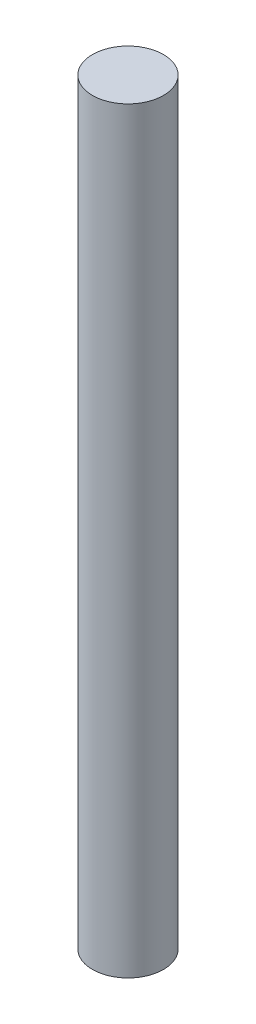
ISO-10303-21;
HEADER;
FILE_DESCRIPTION(('STEP AP214'),'2;1');
FILE_NAME('part.step','',(''),(''),'','','');
FILE_SCHEMA(('AUTOMOTIVE_DESIGN { 1 0 10303 214 1 1 1 1 }'));
ENDSEC;
DATA;
#1=APPLICATION_CONTEXT('core data for automotive mechanical design processes');
#2=APPLICATION_PROTOCOL_DEFINITION('international standard','automotive_design',2000,#1);
#3=PRODUCT_CONTEXT('',#1,'mechanical');
#4=PRODUCT('Part','Part','',(#3));
#5=PRODUCT_RELATED_PRODUCT_CATEGORY('part','',(#4));
#6=PRODUCT_DEFINITION_FORMATION('','',#4);
#7=PRODUCT_DEFINITION_CONTEXT('part definition',#1,'design');
#8=PRODUCT_DEFINITION('design','',#6,#7);
#9=PRODUCT_DEFINITION_SHAPE('','',#8);
#10=(LENGTH_UNIT() NAMED_UNIT(*) SI_UNIT(.MILLI.,.METRE.));
#11=(NAMED_UNIT(*) PLANE_ANGLE_UNIT() SI_UNIT($,.RADIAN.));
#12=(NAMED_UNIT(*) SI_UNIT($,.STERADIAN.) SOLID_ANGLE_UNIT());
#13=UNCERTAINTY_MEASURE_WITH_UNIT(LENGTH_MEASURE(1.E-05),#10,'distance_accuracy_value','');
#14=(GEOMETRIC_REPRESENTATION_CONTEXT(3) GLOBAL_UNCERTAINTY_ASSIGNED_CONTEXT((#13)) GLOBAL_UNIT_ASSIGNED_CONTEXT((#10,
#11,#12)) REPRESENTATION_CONTEXT('',''));
#15=CARTESIAN_POINT('',(0.,0.,0.));
#16=DIRECTION('',(0.,0.,1.));
#17=DIRECTION('',(1.,0.,0.));
#18=AXIS2_PLACEMENT_3D('',#15,#16,#17);
#19=CARTESIAN_POINT('',(0.,101.6,0.));
#20=DIRECTION('',(0.,-1.,0.));
#21=DIRECTION('',(0.,0.,-1.));
#22=AXIS2_PLACEMENT_3D('',#19,#20,#21);
#23=CYLINDRICAL_SURFACE('',#22,4.7625);
#24=CARTESIAN_POINT('',(0.,101.6,0.));
#25=DIRECTION('',(0.,1.,0.));
#26=DIRECTION('',(0.,0.,1.));
#27=AXIS2_PLACEMENT_3D('',#24,#25,#26);
#28=CIRCLE('',#27,4.7625);
#29=CARTESIAN_POINT('',(0.,101.6,4.7625));
#30=VERTEX_POINT('',#29);
#31=EDGE_CURVE('E10',#30,#30,#28,.T.);
#32=ORIENTED_EDGE('',*,*,#31,.F.);
#33=EDGE_LOOP('',(#32));
#34=FACE_BOUND('',#33,.T.);
#35=CARTESIAN_POINT('',(0.,0.,0.));
#36=DIRECTION('',(0.,1.,0.));
#37=DIRECTION('',(0.,0.,1.));
#38=AXIS2_PLACEMENT_3D('',#35,#36,#37);
#39=CIRCLE('',#38,4.7625);
#40=CARTESIAN_POINT('',(0.,0.,4.7625));
#41=VERTEX_POINT('',#40);
#42=EDGE_CURVE('E34',#41,#41,#39,.T.);
#43=ORIENTED_EDGE('',*,*,#42,.T.);
#44=EDGE_LOOP('',(#43));
#45=FACE_BOUND('',#44,.T.);
#46=ADVANCED_FACE('F31',(#34,#45),#23,.T.);
#47=CARTESIAN_POINT('',(0.,101.6,0.));
#48=DIRECTION('',(0.,1.,0.));
#49=DIRECTION('',(0.,0.,1.));
#50=AXIS2_PLACEMENT_3D('',#47,#48,#49);
#51=PLANE('',#50);
#52=ORIENTED_EDGE('',*,*,#31,.T.);
#53=EDGE_LOOP('',(#52));
#54=FACE_BOUND('',#53,.T.);
#55=ADVANCED_FACE('F46',(#54),#51,.T.);
#56=CARTESIAN_POINT('',(0.,0.,0.));
#57=DIRECTION('',(0.,1.,0.));
#58=DIRECTION('',(0.,0.,1.));
#59=AXIS2_PLACEMENT_3D('',#56,#57,#58);
#60=PLANE('',#59);
#61=ORIENTED_EDGE('',*,*,#42,.F.);
#62=EDGE_LOOP('',(#61));
#63=FACE_BOUND('',#62,.T.);
#64=ADVANCED_FACE('F44',(#63),#60,.F.);
#65=CLOSED_SHELL('',(#46,#55,#64));
#66=MANIFOLD_SOLID_BREP('B2',#65);
#67=ADVANCED_BREP_SHAPE_REPRESENTATION('',(#18,#66),#14);
#68=SHAPE_DEFINITION_REPRESENTATION(#9,#67);
ENDSEC;
END-ISO-10303-21;
